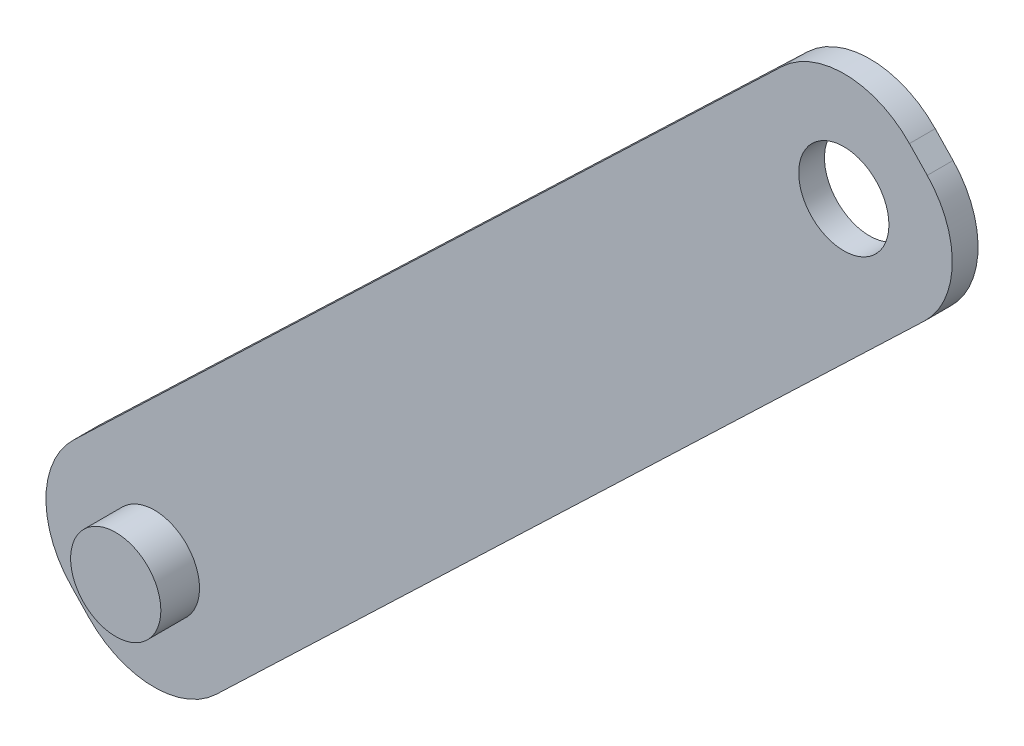
ISO-10303-21;
HEADER;
FILE_DESCRIPTION(('STEP AP214'),'2;1');
FILE_NAME('part.step','',(''),(''),'','','');
FILE_SCHEMA(('AUTOMOTIVE_DESIGN { 1 0 10303 214 1 1 1 1 }'));
ENDSEC;
DATA;
#1=APPLICATION_CONTEXT('core data for automotive mechanical design processes');
#2=APPLICATION_PROTOCOL_DEFINITION('international standard','automotive_design',2000,#1);
#3=PRODUCT_CONTEXT('',#1,'mechanical');
#4=PRODUCT('Part','Part','',(#3));
#5=PRODUCT_RELATED_PRODUCT_CATEGORY('part','',(#4));
#6=PRODUCT_DEFINITION_FORMATION('','',#4);
#7=PRODUCT_DEFINITION_CONTEXT('part definition',#1,'design');
#8=PRODUCT_DEFINITION('design','',#6,#7);
#9=PRODUCT_DEFINITION_SHAPE('','',#8);
#10=(LENGTH_UNIT() NAMED_UNIT(*) SI_UNIT(.MILLI.,.METRE.));
#11=(NAMED_UNIT(*) PLANE_ANGLE_UNIT() SI_UNIT($,.RADIAN.));
#12=(NAMED_UNIT(*) SI_UNIT($,.STERADIAN.) SOLID_ANGLE_UNIT());
#13=UNCERTAINTY_MEASURE_WITH_UNIT(LENGTH_MEASURE(1.E-05),#10,'distance_accuracy_value','');
#14=(GEOMETRIC_REPRESENTATION_CONTEXT(3) GLOBAL_UNCERTAINTY_ASSIGNED_CONTEXT((#13)) GLOBAL_UNIT_ASSIGNED_CONTEXT((#10,
#11,#12)) REPRESENTATION_CONTEXT('',''));
#15=CARTESIAN_POINT('',(0.,0.,0.));
#16=DIRECTION('',(0.,0.,1.));
#17=DIRECTION('',(1.,0.,0.));
#18=AXIS2_PLACEMENT_3D('',#15,#16,#17);
#19=CARTESIAN_POINT('',(32.5871061034476,31.1693565676331,2.));
#20=DIRECTION('',(-0.722652035067117,-0.691212005258412,0.));
#21=DIRECTION('',(0.691212005258412,-0.722652035067117,0.));
#22=AXIS2_PLACEMENT_3D('',#19,#20,#21);
#23=PLANE('',#22);
#24=DIRECTION('',(-0.691212005258412,0.722652035067117,0.));
#25=VECTOR('',#24,1.);
#26=CARTESIAN_POINT('',(32.5871061034476,31.1693565676331,0.));
#27=LINE('',#26,#25);
#28=CARTESIAN_POINT('',(33.2105535832786,30.5175513521132,0.));
#29=VERTEX_POINT('',#28);
#30=CARTESIAN_POINT('',(31.8281295727618,31.9628554222475,0.));
#31=VERTEX_POINT('',#30);
#32=EDGE_CURVE('E147',#29,#31,#27,.T.);
#33=ORIENTED_EDGE('',*,*,#32,.T.);
#34=DIRECTION('',(0.,0.,-1.));
#35=VECTOR('',#34,1.);
#36=CARTESIAN_POINT('',(31.8281295727618,31.9628554222475,2.));
#37=LINE('',#36,#35);
#38=CARTESIAN_POINT('',(31.8281295727618,31.9628554222475,2.));
#39=VERTEX_POINT('',#38);
#40=EDGE_CURVE('E11',#39,#31,#37,.T.);
#41=ORIENTED_EDGE('',*,*,#40,.F.);
#42=DIRECTION('',(-0.691212005258412,0.722652035067117,0.));
#43=VECTOR('',#42,1.);
#44=CARTESIAN_POINT('',(32.5871061034476,31.1693565676331,2.));
#45=LINE('',#44,#43);
#46=CARTESIAN_POINT('',(33.2105535832786,30.5175513521132,2.));
#47=VERTEX_POINT('',#46);
#48=EDGE_CURVE('E212',#47,#39,#45,.T.);
#49=ORIENTED_EDGE('',*,*,#48,.F.);
#50=DIRECTION('',(0.,0.,-1.));
#51=VECTOR('',#50,1.);
#52=CARTESIAN_POINT('',(33.2105535832786,30.5175513521132,2.));
#53=LINE('',#52,#51);
#54=EDGE_CURVE('E139',#47,#29,#53,.T.);
#55=ORIENTED_EDGE('',*,*,#54,.T.);
#56=EDGE_LOOP('',(#33,#41,#49,#55));
#57=FACE_BOUND('',#56,.T.);
#58=ADVANCED_FACE('F41',(#57),#23,.F.);
#59=CARTESIAN_POINT('',(26.769565327292,27.1243713854386,2.));
#60=DIRECTION('',(0.,0.,-1.));
#61=DIRECTION('',(-1.,0.,0.));
#62=AXIS2_PLACEMENT_3D('',#59,#60,#61);
#63=CYLINDRICAL_SURFACE('',#62,7.00000000000002);
#64=CARTESIAN_POINT('',(26.769565327292,27.1243713854386,0.));
#65=DIRECTION('',(0.,0.,1.));
#66=DIRECTION('',(1.,0.,0.));
#67=AXIS2_PLACEMENT_3D('',#64,#65,#66);
#68=CIRCLE('',#67,7.00000000000002);
#69=CARTESIAN_POINT('',(21.931081290483,32.1829356309084,0.));
#70=VERTEX_POINT('',#69);
#71=EDGE_CURVE('E152',#31,#70,#68,.T.);
#72=ORIENTED_EDGE('',*,*,#71,.T.);
#73=DIRECTION('',(0.,0.,-1.));
#74=VECTOR('',#73,1.);
#75=CARTESIAN_POINT('',(21.931081290483,32.1829356309084,2.));
#76=LINE('',#75,#74);
#77=CARTESIAN_POINT('',(21.931081290483,32.1829356309084,2.));
#78=VERTEX_POINT('',#77);
#79=EDGE_CURVE('E51',#78,#70,#76,.T.);
#80=ORIENTED_EDGE('',*,*,#79,.F.);
#81=CARTESIAN_POINT('',(26.769565327292,27.1243713854386,2.));
#82=DIRECTION('',(0.,0.,1.));
#83=DIRECTION('',(1.,0.,0.));
#84=AXIS2_PLACEMENT_3D('',#81,#82,#83);
#85=CIRCLE('',#84,7.00000000000002);
#86=EDGE_CURVE('E102',#39,#78,#85,.T.);
#87=ORIENTED_EDGE('',*,*,#86,.F.);
#88=ORIENTED_EDGE('',*,*,#40,.T.);
#89=EDGE_LOOP('',(#72,#80,#87,#88));
#90=FACE_BOUND('',#89,.T.);
#91=ADVANCED_FACE('F250',(#90),#63,.T.);
#92=CARTESIAN_POINT('',(-5.59746056749463,5.85206310008413,2.));
#93=DIRECTION('',(0.691212005258414,-0.722652035067115,0.));
#94=DIRECTION('',(0.722652035067115,0.691212005258414,0.));
#95=AXIS2_PLACEMENT_3D('',#92,#93,#94);
#96=PLANE('',#95);
#97=DIRECTION('',(-0.722652035067115,-0.691212005258414,0.));
#98=VECTOR('',#97,1.);
#99=CARTESIAN_POINT('',(-5.59746056749463,5.85206310008413,0.));
#100=LINE('',#99,#98);
#101=CARTESIAN_POINT('',(-32.9904733746177,-20.3491767687311,0.));
#102=VERTEX_POINT('',#101);
#103=EDGE_CURVE('E155',#70,#102,#100,.T.);
#104=ORIENTED_EDGE('',*,*,#103,.T.);
#105=DIRECTION('',(0.,0.,-1.));
#106=VECTOR('',#105,1.);
#107=CARTESIAN_POINT('',(-32.9904733746177,-20.3491767687311,2.));
#108=LINE('',#107,#106);
#109=CARTESIAN_POINT('',(-32.9904733746177,-20.3491767687311,2.));
#110=VERTEX_POINT('',#109);
#111=EDGE_CURVE('E181',#110,#102,#108,.T.);
#112=ORIENTED_EDGE('',*,*,#111,.F.);
#113=DIRECTION('',(-0.722652035067115,-0.691212005258414,0.));
#114=VECTOR('',#113,1.);
#115=CARTESIAN_POINT('',(-5.59746056749463,5.85206310008413,2.));
#116=LINE('',#115,#114);
#117=EDGE_CURVE('E191',#78,#110,#116,.T.);
#118=ORIENTED_EDGE('',*,*,#117,.F.);
#119=ORIENTED_EDGE('',*,*,#79,.T.);
#120=EDGE_LOOP('',(#104,#112,#118,#119));
#121=FACE_BOUND('',#120,.T.);
#122=ADVANCED_FACE('F189',(#121),#96,.F.);
#123=CARTESIAN_POINT('',(-28.1519893378088,-25.4077410142009,2.));
#124=DIRECTION('',(0.,0.,-1.));
#125=DIRECTION('',(-1.,0.,0.));
#126=AXIS2_PLACEMENT_3D('',#123,#124,#125);
#127=CYLINDRICAL_SURFACE('',#126,7.);
#128=CARTESIAN_POINT('',(-28.1519893378088,-25.4077410142009,0.));
#129=DIRECTION('',(0.,0.,1.));
#130=DIRECTION('',(1.,0.,0.));
#131=AXIS2_PLACEMENT_3D('',#128,#129,#130);
#132=CIRCLE('',#131,7.);
#133=CARTESIAN_POINT('',(-33.2105535832786,-30.2462250510098,0.));
#134=VERTEX_POINT('',#133);
#135=EDGE_CURVE('E158',#102,#134,#132,.T.);
#136=ORIENTED_EDGE('',*,*,#135,.T.);
#137=DIRECTION('',(0.,0.,-1.));
#138=VECTOR('',#137,1.);
#139=CARTESIAN_POINT('',(-33.2105535832786,-30.2462250510098,2.));
#140=LINE('',#139,#138);
#141=CARTESIAN_POINT('',(-33.2105535832786,-30.2462250510098,2.));
#142=VERTEX_POINT('',#141);
#143=EDGE_CURVE('E177',#142,#134,#140,.T.);
#144=ORIENTED_EDGE('',*,*,#143,.F.);
#145=CARTESIAN_POINT('',(-28.1519893378088,-25.4077410142009,2.));
#146=DIRECTION('',(0.,0.,1.));
#147=DIRECTION('',(1.,0.,0.));
#148=AXIS2_PLACEMENT_3D('',#145,#146,#147);
#149=CIRCLE('',#148,7.);
#150=EDGE_CURVE('E204',#110,#142,#149,.T.);
#151=ORIENTED_EDGE('',*,*,#150,.F.);
#152=ORIENTED_EDGE('',*,*,#111,.T.);
#153=EDGE_LOOP('',(#136,#144,#151,#152));
#154=FACE_BOUND('',#153,.T.);
#155=ADVANCED_FACE('F199',(#154),#127,.T.);
#156=CARTESIAN_POINT('',(-32.4515770525932,-31.0397239056237,2.));
#157=DIRECTION('',(0.722652035067123,0.691212005258405,0.));
#158=DIRECTION('',(-0.691212005258405,0.722652035067123,0.));
#159=AXIS2_PLACEMENT_3D('',#156,#157,#158);
#160=PLANE('',#159);
#161=DIRECTION('',(0.691212005258405,-0.722652035067123,0.));
#162=VECTOR('',#161,1.);
#163=CARTESIAN_POINT('',(-32.4515770525932,-31.0397239056237,0.));
#164=LINE('',#163,#162);
#165=CARTESIAN_POINT('',(-31.8281295727617,-31.691529121144,0.));
#166=VERTEX_POINT('',#165);
#167=EDGE_CURVE('E161',#134,#166,#164,.T.);
#168=ORIENTED_EDGE('',*,*,#167,.T.);
#169=DIRECTION('',(0.,0.,-1.));
#170=VECTOR('',#169,1.);
#171=CARTESIAN_POINT('',(-31.8281295727617,-31.691529121144,2.));
#172=LINE('',#171,#170);
#173=CARTESIAN_POINT('',(-31.8281295727617,-31.691529121144,2.));
#174=VERTEX_POINT('',#173);
#175=EDGE_CURVE('E132',#174,#166,#172,.T.);
#176=ORIENTED_EDGE('',*,*,#175,.F.);
#177=DIRECTION('',(0.691212005258405,-0.722652035067123,0.));
#178=VECTOR('',#177,1.);
#179=CARTESIAN_POINT('',(-32.4515770525932,-31.0397239056237,2.));
#180=LINE('',#179,#178);
#181=EDGE_CURVE('E121',#142,#174,#180,.T.);
#182=ORIENTED_EDGE('',*,*,#181,.F.);
#183=ORIENTED_EDGE('',*,*,#143,.T.);
#184=EDGE_LOOP('',(#168,#176,#182,#183));
#185=FACE_BOUND('',#184,.T.);
#186=ADVANCED_FACE('F202',(#185),#160,.F.);
#187=CARTESIAN_POINT('',(-26.769565327292,-26.8530450843351,2.));
#188=DIRECTION('',(0.,0.,-1.));
#189=DIRECTION('',(-1.,0.,0.));
#190=AXIS2_PLACEMENT_3D('',#187,#188,#189);
#191=CYLINDRICAL_SURFACE('',#190,7.00000000000002);
#192=CARTESIAN_POINT('',(-26.769565327292,-26.8530450843351,0.));
#193=DIRECTION('',(0.,0.,1.));
#194=DIRECTION('',(1.,0.,0.));
#195=AXIS2_PLACEMENT_3D('',#192,#193,#194);
#196=CIRCLE('',#195,7.00000000000002);
#197=CARTESIAN_POINT('',(-21.931081290483,-31.9116093298049,0.));
#198=VERTEX_POINT('',#197);
#199=EDGE_CURVE('E130',#166,#198,#196,.T.);
#200=ORIENTED_EDGE('',*,*,#199,.T.);
#201=DIRECTION('',(0.,0.,-1.));
#202=VECTOR('',#201,1.);
#203=CARTESIAN_POINT('',(-21.931081290483,-31.9116093298049,2.));
#204=LINE('',#203,#202);
#205=CARTESIAN_POINT('',(-21.931081290483,-31.9116093298049,2.));
#206=VERTEX_POINT('',#205);
#207=EDGE_CURVE('E127',#206,#198,#204,.T.);
#208=ORIENTED_EDGE('',*,*,#207,.F.);
#209=CARTESIAN_POINT('',(-26.769565327292,-26.8530450843351,2.));
#210=DIRECTION('',(0.,0.,1.));
#211=DIRECTION('',(1.,0.,0.));
#212=AXIS2_PLACEMENT_3D('',#209,#210,#211);
#213=CIRCLE('',#212,7.00000000000002);
#214=EDGE_CURVE('E115',#174,#206,#213,.T.);
#215=ORIENTED_EDGE('',*,*,#214,.F.);
#216=ORIENTED_EDGE('',*,*,#175,.T.);
#217=EDGE_LOOP('',(#200,#208,#215,#216));
#218=FACE_BOUND('',#217,.T.);
#219=ADVANCED_FACE('F128',(#218),#191,.T.);
#220=CARTESIAN_POINT('',(5.46193151664001,-5.71036946098972,2.));
#221=DIRECTION('',(-0.691212005258414,0.722652035067115,0.));
#222=DIRECTION('',(-0.722652035067115,-0.691212005258414,0.));
#223=AXIS2_PLACEMENT_3D('',#220,#221,#222);
#224=PLANE('',#223);
#225=DIRECTION('',(0.722652035067115,0.691212005258414,0.));
#226=VECTOR('',#225,1.);
#227=CARTESIAN_POINT('',(5.46193151664001,-5.71036946098972,0.));
#228=LINE('',#227,#226);
#229=CARTESIAN_POINT('',(32.9904733746177,20.6205030698345,0.));
#230=VERTEX_POINT('',#229);
#231=EDGE_CURVE('E88',#198,#230,#228,.T.);
#232=ORIENTED_EDGE('',*,*,#231,.T.);
#233=DIRECTION('',(0.,0.,-1.));
#234=VECTOR('',#233,1.);
#235=CARTESIAN_POINT('',(32.9904733746177,20.6205030698345,2.));
#236=LINE('',#235,#234);
#237=CARTESIAN_POINT('',(32.9904733746177,20.6205030698345,2.));
#238=VERTEX_POINT('',#237);
#239=EDGE_CURVE('E133',#238,#230,#236,.T.);
#240=ORIENTED_EDGE('',*,*,#239,.F.);
#241=DIRECTION('',(0.722652035067115,0.691212005258414,0.));
#242=VECTOR('',#241,1.);
#243=CARTESIAN_POINT('',(5.46193151664001,-5.71036946098972,2.));
#244=LINE('',#243,#242);
#245=EDGE_CURVE('E119',#206,#238,#244,.T.);
#246=ORIENTED_EDGE('',*,*,#245,.F.);
#247=ORIENTED_EDGE('',*,*,#207,.T.);
#248=EDGE_LOOP('',(#232,#240,#246,#247));
#249=FACE_BOUND('',#248,.T.);
#250=ADVANCED_FACE('F135',(#249),#224,.F.);
#251=CARTESIAN_POINT('',(26.7381252974832,25.710507345113,2.));
#252=DIRECTION('',(0.,0.,-1.));
#253=DIRECTION('',(-1.,0.,0.));
#254=AXIS2_PLACEMENT_3D('',#251,#252,#253);
#255=CYLINDRICAL_SURFACE('',#254,3.50000000000001);
#256=CARTESIAN_POINT('',(26.7381252974832,25.710507345113,2.));
#257=DIRECTION('',(0.,0.,1.));
#258=DIRECTION('',(1.,0.,0.));
#259=AXIS2_PLACEMENT_3D('',#256,#257,#258);
#260=CIRCLE('',#259,3.50000000000001);
#261=CARTESIAN_POINT('',(30.2381252974832,25.710507345113,2.));
#262=VERTEX_POINT('',#261);
#263=EDGE_CURVE('E170',#262,#262,#260,.T.);
#264=ORIENTED_EDGE('',*,*,#263,.T.);
#265=EDGE_LOOP('',(#264));
#266=FACE_BOUND('',#265,.T.);
#267=CARTESIAN_POINT('',(26.7381252974832,25.710507345113,0.));
#268=DIRECTION('',(0.,0.,1.));
#269=DIRECTION('',(1.,0.,0.));
#270=AXIS2_PLACEMENT_3D('',#267,#268,#269);
#271=CIRCLE('',#270,3.50000000000001);
#272=CARTESIAN_POINT('',(30.2381252974832,25.710507345113,0.));
#273=VERTEX_POINT('',#272);
#274=EDGE_CURVE('E143',#273,#273,#271,.T.);
#275=ORIENTED_EDGE('',*,*,#274,.F.);
#276=EDGE_LOOP('',(#275));
#277=FACE_BOUND('',#276,.T.);
#278=ADVANCED_FACE('F43',(#266,#277),#255,.F.);
#279=CARTESIAN_POINT('',(28.1519893378088,25.6790673153043,2.));
#280=DIRECTION('',(0.,0.,-1.));
#281=DIRECTION('',(-1.,0.,0.));
#282=AXIS2_PLACEMENT_3D('',#279,#280,#281);
#283=CYLINDRICAL_SURFACE('',#282,7.00000000000001);
#284=CARTESIAN_POINT('',(28.1519893378088,25.6790673153043,0.));
#285=DIRECTION('',(0.,0.,1.));
#286=DIRECTION('',(1.,0.,0.));
#287=AXIS2_PLACEMENT_3D('',#284,#285,#286);
#288=CIRCLE('',#287,7.00000000000001);
#289=EDGE_CURVE('E94',#230,#29,#288,.T.);
#290=ORIENTED_EDGE('',*,*,#289,.T.);
#291=ORIENTED_EDGE('',*,*,#54,.F.);
#292=CARTESIAN_POINT('',(28.1519893378088,25.6790673153043,2.));
#293=DIRECTION('',(0.,0.,1.));
#294=DIRECTION('',(1.,0.,0.));
#295=AXIS2_PLACEMENT_3D('',#292,#293,#294);
#296=CIRCLE('',#295,7.00000000000001);
#297=EDGE_CURVE('E59',#238,#47,#296,.T.);
#298=ORIENTED_EDGE('',*,*,#297,.F.);
#299=ORIENTED_EDGE('',*,*,#239,.T.);
#300=EDGE_LOOP('',(#290,#291,#298,#299));
#301=FACE_BOUND('',#300,.T.);
#302=ADVANCED_FACE('F236',(#301),#283,.T.);
#303=CARTESIAN_POINT('',(0.,0.,2.));
#304=DIRECTION('',(0.,0.,1.));
#305=DIRECTION('',(1.,0.,0.));
#306=AXIS2_PLACEMENT_3D('',#303,#304,#305);
#307=PLANE('',#306);
#308=CARTESIAN_POINT('',(-26.7381252974833,-25.4391810440096,2.));
#309=DIRECTION('',(0.,0.,1.));
#310=DIRECTION('',(1.,0.,0.));
#311=AXIS2_PLACEMENT_3D('',#308,#309,#310);
#312=CIRCLE('',#311,3.5);
#313=CARTESIAN_POINT('',(-23.2381252974833,-25.4391810440096,2.));
#314=VERTEX_POINT('',#313);
#315=EDGE_CURVE('E218',#314,#314,#312,.T.);
#316=ORIENTED_EDGE('',*,*,#315,.F.);
#317=EDGE_LOOP('',(#316));
#318=FACE_BOUND('',#317,.T.);
#319=ORIENTED_EDGE('',*,*,#263,.F.);
#320=EDGE_LOOP('',(#319));
#321=FACE_BOUND('',#320,.T.);
#322=ORIENTED_EDGE('',*,*,#48,.T.);
#323=ORIENTED_EDGE('',*,*,#86,.T.);
#324=ORIENTED_EDGE('',*,*,#117,.T.);
#325=ORIENTED_EDGE('',*,*,#150,.T.);
#326=ORIENTED_EDGE('',*,*,#181,.T.);
#327=ORIENTED_EDGE('',*,*,#214,.T.);
#328=ORIENTED_EDGE('',*,*,#245,.T.);
#329=ORIENTED_EDGE('',*,*,#297,.T.);
#330=EDGE_LOOP('',(#322,#323,#324,#325,#326,#327,#328,#329));
#331=FACE_BOUND('',#330,.T.);
#332=ADVANCED_FACE('F117',(#318,#321,#331),#307,.T.);
#333=CARTESIAN_POINT('',(0.,0.,0.));
#334=DIRECTION('',(0.,0.,1.));
#335=DIRECTION('',(1.,0.,0.));
#336=AXIS2_PLACEMENT_3D('',#333,#334,#335);
#337=PLANE('',#336);
#338=ORIENTED_EDGE('',*,*,#274,.T.);
#339=EDGE_LOOP('',(#338));
#340=FACE_BOUND('',#339,.T.);
#341=ORIENTED_EDGE('',*,*,#32,.F.);
#342=ORIENTED_EDGE('',*,*,#289,.F.);
#343=ORIENTED_EDGE('',*,*,#231,.F.);
#344=ORIENTED_EDGE('',*,*,#199,.F.);
#345=ORIENTED_EDGE('',*,*,#167,.F.);
#346=ORIENTED_EDGE('',*,*,#135,.F.);
#347=ORIENTED_EDGE('',*,*,#103,.F.);
#348=ORIENTED_EDGE('',*,*,#71,.F.);
#349=EDGE_LOOP('',(#341,#342,#343,#344,#345,#346,#347,#348));
#350=FACE_BOUND('',#349,.T.);
#351=ADVANCED_FACE('F195',(#340,#350),#337,.F.);
#352=CARTESIAN_POINT('',(-26.7381252974833,-25.4391810440096,5.));
#353=DIRECTION('',(0.,0.,-1.));
#354=DIRECTION('',(-1.,0.,0.));
#355=AXIS2_PLACEMENT_3D('',#352,#353,#354);
#356=CYLINDRICAL_SURFACE('',#355,3.5);
#357=CARTESIAN_POINT('',(-26.7381252974833,-25.4391810440096,5.));
#358=DIRECTION('',(0.,0.,1.));
#359=DIRECTION('',(1.,0.,0.));
#360=AXIS2_PLACEMENT_3D('',#357,#358,#359);
#361=CIRCLE('',#360,3.5);
#362=CARTESIAN_POINT('',(-23.2381252974833,-25.4391810440096,5.));
#363=VERTEX_POINT('',#362);
#364=EDGE_CURVE('E148',#363,#363,#361,.T.);
#365=ORIENTED_EDGE('',*,*,#364,.F.);
#366=EDGE_LOOP('',(#365));
#367=FACE_BOUND('',#366,.T.);
#368=ORIENTED_EDGE('',*,*,#315,.T.);
#369=EDGE_LOOP('',(#368));
#370=FACE_BOUND('',#369,.T.);
#371=ADVANCED_FACE('F228',(#367,#370),#356,.T.);
#372=CARTESIAN_POINT('',(-26.7381252974833,-25.4391810440096,5.));
#373=DIRECTION('',(0.,0.,1.));
#374=DIRECTION('',(1.,0.,0.));
#375=AXIS2_PLACEMENT_3D('',#372,#373,#374);
#376=PLANE('',#375);
#377=ORIENTED_EDGE('',*,*,#364,.T.);
#378=EDGE_LOOP('',(#377));
#379=FACE_BOUND('',#378,.T.);
#380=ADVANCED_FACE('F226',(#379),#376,.T.);
#381=CLOSED_SHELL('',(#58,#91,#122,#155,#186,#219,#250,#278,#302,#332,#351,#371,#380));
#382=MANIFOLD_SOLID_BREP('B2',#381);
#383=ADVANCED_BREP_SHAPE_REPRESENTATION('',(#18,#382),#14);
#384=SHAPE_DEFINITION_REPRESENTATION(#9,#383);
ENDSEC;
END-ISO-10303-21;
